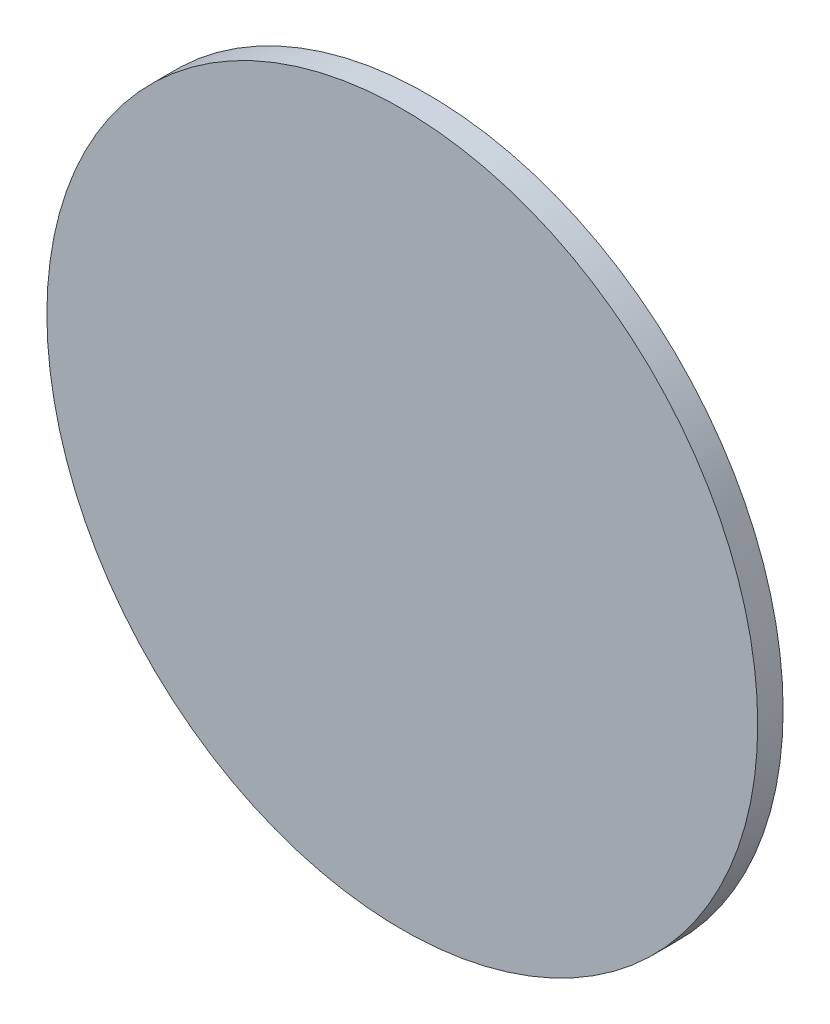
ISO-10303-21;
HEADER;
FILE_DESCRIPTION(('STEP AP214'),'2;1');
FILE_NAME('part.step','',(''),(''),'','','');
FILE_SCHEMA(('AUTOMOTIVE_DESIGN { 1 0 10303 214 1 1 1 1 }'));
ENDSEC;
DATA;
#1=APPLICATION_CONTEXT('core data for automotive mechanical design processes');
#2=APPLICATION_PROTOCOL_DEFINITION('international standard','automotive_design',2000,#1);
#3=PRODUCT_CONTEXT('',#1,'mechanical');
#4=PRODUCT('Part','Part','',(#3));
#5=PRODUCT_RELATED_PRODUCT_CATEGORY('part','',(#4));
#6=PRODUCT_DEFINITION_FORMATION('','',#4);
#7=PRODUCT_DEFINITION_CONTEXT('part definition',#1,'design');
#8=PRODUCT_DEFINITION('design','',#6,#7);
#9=PRODUCT_DEFINITION_SHAPE('','',#8);
#10=(LENGTH_UNIT() NAMED_UNIT(*) SI_UNIT(.MILLI.,.METRE.));
#11=(NAMED_UNIT(*) PLANE_ANGLE_UNIT() SI_UNIT($,.RADIAN.));
#12=(NAMED_UNIT(*) SI_UNIT($,.STERADIAN.) SOLID_ANGLE_UNIT());
#13=UNCERTAINTY_MEASURE_WITH_UNIT(LENGTH_MEASURE(1.E-05),#10,'distance_accuracy_value','');
#14=(GEOMETRIC_REPRESENTATION_CONTEXT(3) GLOBAL_UNCERTAINTY_ASSIGNED_CONTEXT((#13)) GLOBAL_UNIT_ASSIGNED_CONTEXT((#10,
#11,#12)) REPRESENTATION_CONTEXT('',''));
#15=CARTESIAN_POINT('',(0.,0.,0.));
#16=DIRECTION('',(0.,0.,1.));
#17=DIRECTION('',(1.,0.,0.));
#18=AXIS2_PLACEMENT_3D('',#15,#16,#17);
#19=CARTESIAN_POINT('',(0.,0.,3.175));
#20=DIRECTION('',(0.,0.,-1.));
#21=DIRECTION('',(-1.,0.,0.));
#22=AXIS2_PLACEMENT_3D('',#19,#20,#21);
#23=CYLINDRICAL_SURFACE('',#22,44.45);
#24=CARTESIAN_POINT('',(0.,0.,3.175));
#25=DIRECTION('',(0.,0.,1.));
#26=DIRECTION('',(1.,0.,0.));
#27=AXIS2_PLACEMENT_3D('',#24,#25,#26);
#28=CIRCLE('',#27,44.45);
#29=CARTESIAN_POINT('',(44.45,0.,3.175));
#30=VERTEX_POINT('',#29);
#31=EDGE_CURVE('E10',#30,#30,#28,.T.);
#32=ORIENTED_EDGE('',*,*,#31,.F.);
#33=EDGE_LOOP('',(#32));
#34=FACE_BOUND('',#33,.T.);
#35=CARTESIAN_POINT('',(0.,0.,0.));
#36=DIRECTION('',(0.,0.,1.));
#37=DIRECTION('',(1.,0.,0.));
#38=AXIS2_PLACEMENT_3D('',#35,#36,#37);
#39=CIRCLE('',#38,44.45);
#40=CARTESIAN_POINT('',(44.45,0.,0.));
#41=VERTEX_POINT('',#40);
#42=EDGE_CURVE('E32',#41,#41,#39,.T.);
#43=ORIENTED_EDGE('',*,*,#42,.T.);
#44=EDGE_LOOP('',(#43));
#45=FACE_BOUND('',#44,.T.);
#46=ADVANCED_FACE('F29',(#34,#45),#23,.T.);
#47=CARTESIAN_POINT('',(0.,0.,3.175));
#48=DIRECTION('',(0.,0.,1.));
#49=DIRECTION('',(1.,0.,0.));
#50=AXIS2_PLACEMENT_3D('',#47,#48,#49);
#51=PLANE('',#50);
#52=ORIENTED_EDGE('',*,*,#31,.T.);
#53=EDGE_LOOP('',(#52));
#54=FACE_BOUND('',#53,.T.);
#55=ADVANCED_FACE('F44',(#54),#51,.T.);
#56=CARTESIAN_POINT('',(0.,0.,0.));
#57=DIRECTION('',(0.,0.,1.));
#58=DIRECTION('',(1.,0.,0.));
#59=AXIS2_PLACEMENT_3D('',#56,#57,#58);
#60=PLANE('',#59);
#61=ORIENTED_EDGE('',*,*,#42,.F.);
#62=EDGE_LOOP('',(#61));
#63=FACE_BOUND('',#62,.T.);
#64=ADVANCED_FACE('F42',(#63),#60,.F.);
#65=CLOSED_SHELL('',(#46,#55,#64));
#66=MANIFOLD_SOLID_BREP('B2',#65);
#67=ADVANCED_BREP_SHAPE_REPRESENTATION('',(#18,#66),#14);
#68=SHAPE_DEFINITION_REPRESENTATION(#9,#67);
ENDSEC;
END-ISO-10303-21;
